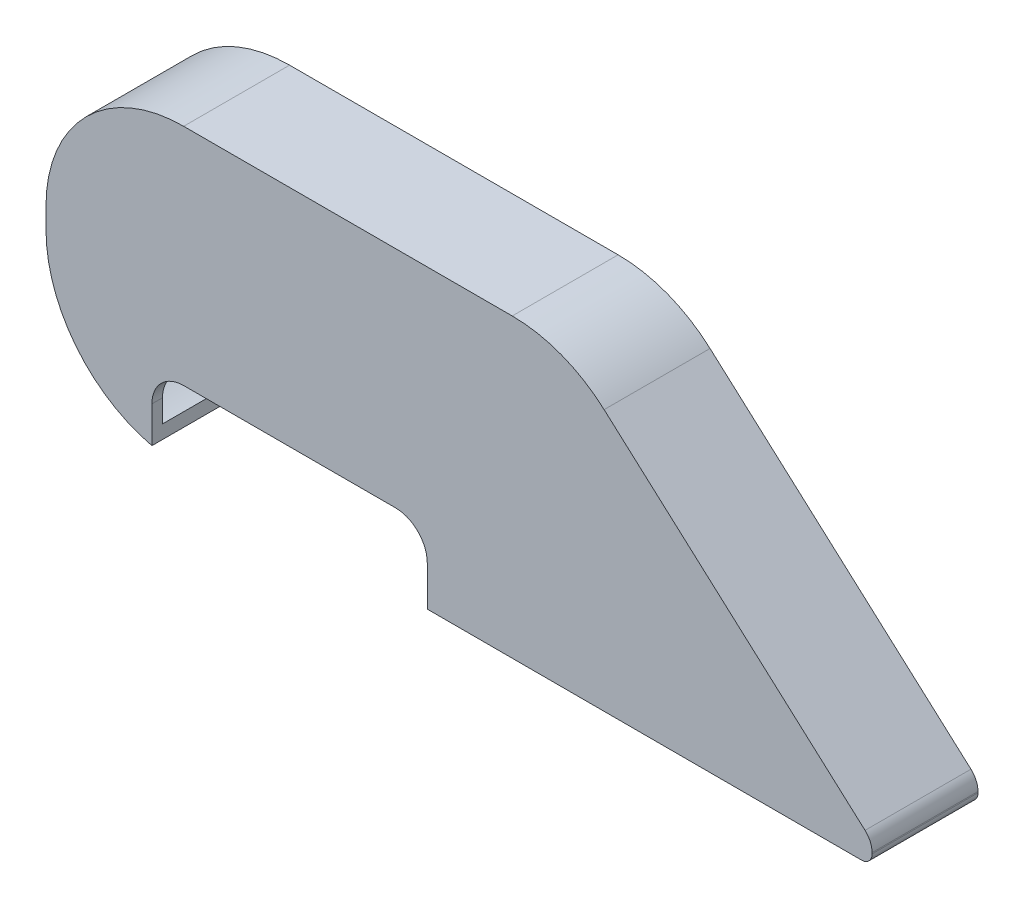
ISO-10303-21;
HEADER;
FILE_DESCRIPTION(('STEP AP214'),'2;1');
FILE_NAME('part.step','',(''),(''),'','','');
FILE_SCHEMA(('AUTOMOTIVE_DESIGN { 1 0 10303 214 1 1 1 1 }'));
ENDSEC;
DATA;
#1=APPLICATION_CONTEXT('core data for automotive mechanical design processes');
#2=APPLICATION_PROTOCOL_DEFINITION('international standard','automotive_design',2000,#1);
#3=PRODUCT_CONTEXT('',#1,'mechanical');
#4=PRODUCT('Part','Part','',(#3));
#5=PRODUCT_RELATED_PRODUCT_CATEGORY('part','',(#4));
#6=PRODUCT_DEFINITION_FORMATION('','',#4);
#7=PRODUCT_DEFINITION_CONTEXT('part definition',#1,'design');
#8=PRODUCT_DEFINITION('design','',#6,#7);
#9=PRODUCT_DEFINITION_SHAPE('','',#8);
#10=(LENGTH_UNIT() NAMED_UNIT(*) SI_UNIT(.MILLI.,.METRE.));
#11=(NAMED_UNIT(*) PLANE_ANGLE_UNIT() SI_UNIT($,.RADIAN.));
#12=(NAMED_UNIT(*) SI_UNIT($,.STERADIAN.) SOLID_ANGLE_UNIT());
#13=UNCERTAINTY_MEASURE_WITH_UNIT(LENGTH_MEASURE(1.E-05),#10,'distance_accuracy_value','');
#14=(GEOMETRIC_REPRESENTATION_CONTEXT(3) GLOBAL_UNCERTAINTY_ASSIGNED_CONTEXT((#13)) GLOBAL_UNIT_ASSIGNED_CONTEXT((#10,
#11,#12)) REPRESENTATION_CONTEXT('',''));
#15=CARTESIAN_POINT('',(0.,0.,0.));
#16=DIRECTION('',(0.,0.,1.));
#17=DIRECTION('',(1.,0.,0.));
#18=AXIS2_PLACEMENT_3D('',#15,#16,#17);
#19=CARTESIAN_POINT('',(0.,0.,0.));
#20=DIRECTION('',(0.,0.,-1.));
#21=DIRECTION('',(-1.,0.,0.));
#22=AXIS2_PLACEMENT_3D('',#19,#20,#21);
#23=PLANE('',#22);
#24=DIRECTION('',(0.,1.,0.));
#25=VECTOR('',#24,1.);
#26=CARTESIAN_POINT('',(11.0043937433295,0.,0.));
#27=LINE('',#26,#25);
#28=CARTESIAN_POINT('',(11.0043937433295,1.38069056825095,0.));
#29=VERTEX_POINT('',#28);
#30=CARTESIAN_POINT('',(11.0043937433295,2.66062873601207,0.));
#31=VERTEX_POINT('',#30);
#32=EDGE_CURVE('E353',#29,#31,#27,.T.);
#33=ORIENTED_EDGE('',*,*,#32,.F.);
#34=CARTESIAN_POINT('',(14.0043937433295,14.0298012089245,0.));
#35=DIRECTION('',(0.,0.,-1.));
#36=DIRECTION('',(-1.,0.,0.));
#37=AXIS2_PLACEMENT_3D('',#34,#35,#36);
#38=CIRCLE('',#37,13.);
#39=CARTESIAN_POINT('',(1.0043937433295,14.0298012089245,0.));
#40=VERTEX_POINT('',#39);
#41=EDGE_CURVE('E275',#29,#40,#38,.T.);
#42=ORIENTED_EDGE('',*,*,#41,.T.);
#43=DIRECTION('',(0.,-1.,0.));
#44=VECTOR('',#43,1.);
#45=CARTESIAN_POINT('',(1.0043937433295,28.998403262257,0.));
#46=LINE('',#45,#44);
#47=CARTESIAN_POINT('',(1.0043937433295,15.9991614446246,0.));
#48=VERTEX_POINT('',#47);
#49=EDGE_CURVE('E233',#48,#40,#46,.T.);
#50=ORIENTED_EDGE('',*,*,#49,.F.);
#51=CARTESIAN_POINT('',(14.0043937433295,15.9991614446246,0.));
#52=DIRECTION('',(0.,0.,-1.));
#53=DIRECTION('',(-1.,0.,0.));
#54=AXIS2_PLACEMENT_3D('',#51,#52,#53);
#55=CIRCLE('',#54,13.);
#56=CARTESIAN_POINT('',(14.0036355388527,28.999161422514,0.));
#57=VERTEX_POINT('',#56);
#58=EDGE_CURVE('E267',#48,#57,#55,.T.);
#59=ORIENTED_EDGE('',*,*,#58,.T.);
#60=DIRECTION('',(-0.999999998299189,-5.83234212952014E-05,0.));
#61=VECTOR('',#60,1.);
#62=CARTESIAN_POINT('',(50.,29.0012608536472,0.));
#63=LINE('',#62,#61);
#64=CARTESIAN_POINT('',(45.0257927198774,29.0009707408599,0.));
#65=VERTEX_POINT('',#64);
#66=EDGE_CURVE('E238',#65,#57,#63,.T.);
#67=ORIENTED_EDGE('',*,*,#66,.F.);
#68=CARTESIAN_POINT('',(45.0265509243543,16.0009707629704,0.));
#69=DIRECTION('',(0.,0.,-1.));
#70=DIRECTION('',(-1.,0.,0.));
#71=AXIS2_PLACEMENT_3D('',#68,#69,#70);
#72=CIRCLE('',#71,13.);
#73=CARTESIAN_POINT('',(53.7038964611965,25.6810365909616,0.));
#74=VERTEX_POINT('',#73);
#75=EDGE_CURVE('E284',#65,#74,#72,.T.);
#76=ORIENTED_EDGE('',*,*,#75,.T.);
#77=DIRECTION('',(-0.744620448307016,0.667488118218638,0.));
#78=VECTOR('',#77,1.);
#79=CARTESIAN_POINT('',(79.0058654003616,3.,0.));
#80=LINE('',#79,#78);
#81=CARTESIAN_POINT('',(78.3408416367989,3.59613654381962,0.));
#82=VERTEX_POINT('',#81);
#83=EDGE_CURVE('E393',#82,#74,#80,.T.);
#84=ORIENTED_EDGE('',*,*,#83,.F.);
#85=CARTESIAN_POINT('',(77.0058654003616,2.10689564720559,0.));
#86=DIRECTION('',(0.,0.,-1.));
#87=DIRECTION('',(-1.,0.,0.));
#88=AXIS2_PLACEMENT_3D('',#85,#86,#87);
#89=CIRCLE('',#88,2.);
#90=CARTESIAN_POINT('',(79.0058654003616,2.10689564720559,0.));
#91=VERTEX_POINT('',#90);
#92=EDGE_CURVE('E294',#82,#91,#89,.T.);
#93=ORIENTED_EDGE('',*,*,#92,.T.);
#94=DIRECTION('',(0.,1.,0.));
#95=VECTOR('',#94,1.);
#96=CARTESIAN_POINT('',(79.0058654003616,0.99365877458979,0.));
#97=LINE('',#96,#95);
#98=CARTESIAN_POINT('',(79.0058654003616,1.9942149231046,0.));
#99=VERTEX_POINT('',#98);
#100=EDGE_CURVE('E391',#99,#91,#97,.T.);
#101=ORIENTED_EDGE('',*,*,#100,.F.);
#102=CARTESIAN_POINT('',(78.0058654003616,1.9942149231046,0.));
#103=DIRECTION('',(0.,0.,-1.));
#104=DIRECTION('',(-1.,0.,0.));
#105=AXIS2_PLACEMENT_3D('',#102,#103,#104);
#106=CIRCLE('',#105,1.);
#107=CARTESIAN_POINT('',(78.0053094064973,0.994215077669201,0.));
#108=VERTEX_POINT('',#107);
#109=EDGE_CURVE('E302',#99,#108,#106,.T.);
#110=ORIENTED_EDGE('',*,*,#109,.T.);
#111=DIRECTION('',(0.999999845435399,-0.000555993864250044,0.));
#112=VECTOR('',#111,1.);
#113=CARTESIAN_POINT('',(1.0043937433295,1.03702712093678,0.));
#114=LINE('',#113,#112);
#115=CARTESIAN_POINT('',(37.0043937433295,1.01701133873005,0.));
#116=VERTEX_POINT('',#115);
#117=EDGE_CURVE('E389',#116,#108,#114,.T.);
#118=ORIENTED_EDGE('',*,*,#117,.F.);
#119=DIRECTION('',(0.,-1.,0.));
#120=VECTOR('',#119,1.);
#121=CARTESIAN_POINT('',(37.0043937433295,0.,0.));
#122=LINE('',#121,#120);
#123=CARTESIAN_POINT('',(37.0043937433295,2.01538120667124,0.));
#124=VERTEX_POINT('',#123);
#125=EDGE_CURVE('E203',#124,#116,#122,.T.);
#126=ORIENTED_EDGE('',*,*,#125,.F.);
#127=DIRECTION('',(-0.999999835320256,0.000573898475952586,0.));
#128=VECTOR('',#127,1.);
#129=CARTESIAN_POINT('',(2.00811371005572,2.03546552175382,0.));
#130=LINE('',#129,#128);
#131=CARTESIAN_POINT('',(77.5024113049082,1.9921394522861,0.));
#132=VERTEX_POINT('',#131);
#133=EDGE_CURVE('E382',#132,#124,#130,.T.);
#134=ORIENTED_EDGE('',*,*,#133,.F.);
#135=CARTESIAN_POINT('',(77.5026982541462,2.49213936994623,0.));
#136=DIRECTION('',(0.,0.,-1.));
#137=DIRECTION('',(-1.,0.,0.));
#138=AXIS2_PLACEMENT_3D('',#135,#136,#137);
#139=CIRCLE('',#138,0.5);
#140=CARTESIAN_POINT('',(78.0026982541462,2.49213936994623,0.));
#141=VERTEX_POINT('',#140);
#142=EDGE_CURVE('E313',#132,#141,#139,.F.);
#143=ORIENTED_EDGE('',*,*,#142,.T.);
#144=DIRECTION('',(0.,-1.,0.));
#145=VECTOR('',#144,1.);
#146=CARTESIAN_POINT('',(78.0026982541462,1.99185233832111,0.));
#147=LINE('',#146,#145);
#148=CARTESIAN_POINT('',(78.0026982541462,2.5522717028357,0.));
#149=VERTEX_POINT('',#148);
#150=EDGE_CURVE('E380',#149,#141,#147,.T.);
#151=ORIENTED_EDGE('',*,*,#150,.F.);
#152=CARTESIAN_POINT('',(77.0026982541462,2.5522717028357,0.));
#153=DIRECTION('',(0.,0.,-1.));
#154=DIRECTION('',(-1.,0.,0.));
#155=AXIS2_PLACEMENT_3D('',#152,#153,#154);
#156=CIRCLE('',#155,1.);
#157=CARTESIAN_POINT('',(77.6687254050708,3.29819920214866,0.));
#158=VERTEX_POINT('',#157);
#159=EDGE_CURVE('E323',#149,#158,#156,.F.);
#160=ORIENTED_EDGE('',*,*,#159,.T.);
#161=DIRECTION('',(0.74592749931296,-0.666027150924581,0.));
#162=VECTOR('',#161,1.);
#163=CARTESIAN_POINT('',(78.0026982541462,3.,0.));
#164=LINE('',#163,#162);
#165=CARTESIAN_POINT('',(53.6991819967723,24.7002345472675,0.));
#166=VERTEX_POINT('',#165);
#167=EDGE_CURVE('E207',#166,#158,#164,.T.);
#168=ORIENTED_EDGE('',*,*,#167,.F.);
#169=CARTESIAN_POINT('',(45.0408290347528,15.003177056199,0.));
#170=DIRECTION('',(0.,0.,-1.));
#171=DIRECTION('',(-1.,0.,0.));
#172=AXIS2_PLACEMENT_3D('',#169,#170,#171);
#173=CIRCLE('',#172,13.);
#174=CARTESIAN_POINT('',(45.0408290347528,28.003177056199,0.));
#175=VERTEX_POINT('',#174);
#176=EDGE_CURVE('E258',#166,#175,#173,.F.);
#177=ORIENTED_EDGE('',*,*,#176,.T.);
#178=DIRECTION('',(1.,0.,0.));
#179=VECTOR('',#178,1.);
#180=CARTESIAN_POINT('',(50.,28.003177056199,0.));
#181=LINE('',#180,#179);
#182=CARTESIAN_POINT('',(15.01040702453,28.003177056199,0.));
#183=VERTEX_POINT('',#182);
#184=EDGE_CURVE('E371',#183,#175,#181,.T.);
#185=ORIENTED_EDGE('',*,*,#184,.F.);
#186=CARTESIAN_POINT('',(15.01040702453,15.003177056199,0.));
#187=DIRECTION('',(0.,0.,-1.));
#188=DIRECTION('',(-1.,0.,0.));
#189=AXIS2_PLACEMENT_3D('',#186,#187,#188);
#190=CIRCLE('',#189,13.);
#191=CARTESIAN_POINT('',(2.01040722778299,15.0054758770304,0.));
#192=VERTEX_POINT('',#191);
#193=EDGE_CURVE('E243',#183,#192,#190,.F.);
#194=ORIENTED_EDGE('',*,*,#193,.T.);
#195=CARTESIAN_POINT('',(15.010387705005,15.0280056761324,0.));
#196=DIRECTION('',(0.,0.,-1.));
#197=DIRECTION('',(-1.,0.,0.));
#198=AXIS2_PLACEMENT_3D('',#195,#196,#197);
#199=CIRCLE('',#198,13.);
#200=EDGE_CURVE('E248',#192,#31,#199,.F.);
#201=ORIENTED_EDGE('',*,*,#200,.T.);
#202=EDGE_LOOP('',(#33,#42,#50,#59,#67,#76,#84,#93,#101,#110,#118,#126,#134,#143,#151,#160,#168,
#177,#185,#194,#201));
#203=FACE_BOUND('',#202,.T.);
#204=ADVANCED_FACE('F35',(#203),#23,.T.);
#205=CARTESIAN_POINT('',(1.0043937433295,28.998403262257,0.));
#206=DIRECTION('',(-1.,0.,0.));
#207=DIRECTION('',(0.,0.,1.));
#208=AXIS2_PLACEMENT_3D('',#205,#206,#207);
#209=PLANE('',#208);
#210=ORIENTED_EDGE('',*,*,#49,.T.);
#211=DIRECTION('',(0.,0.,1.));
#212=VECTOR('',#211,1.);
#213=CARTESIAN_POINT('',(1.0043937433295,14.0298012089245,0.));
#214=LINE('',#213,#212);
#215=CARTESIAN_POINT('',(1.0043937433295,14.0298012089245,10.));
#216=VERTEX_POINT('',#215);
#217=EDGE_CURVE('E270',#40,#216,#214,.T.);
#218=ORIENTED_EDGE('',*,*,#217,.T.);
#219=DIRECTION('',(0.,-1.,0.));
#220=VECTOR('',#219,1.);
#221=CARTESIAN_POINT('',(1.0043937433295,28.998403262257,10.));
#222=LINE('',#221,#220);
#223=CARTESIAN_POINT('',(1.0043937433295,15.9991614446246,10.));
#224=VERTEX_POINT('',#223);
#225=EDGE_CURVE('E221',#224,#216,#222,.T.);
#226=ORIENTED_EDGE('',*,*,#225,.F.);
#227=DIRECTION('',(0.,0.,1.));
#228=VECTOR('',#227,1.);
#229=CARTESIAN_POINT('',(1.0043937433295,15.9991614446246,0.));
#230=LINE('',#229,#228);
#231=EDGE_CURVE('E265',#224,#48,#230,.F.);
#232=ORIENTED_EDGE('',*,*,#231,.T.);
#233=EDGE_LOOP('',(#210,#218,#226,#232));
#234=FACE_BOUND('',#233,.T.);
#235=ADVANCED_FACE('F411',(#234),#209,.T.);
#236=CARTESIAN_POINT('',(50.,29.0012608536472,0.));
#237=DIRECTION('',(-5.83234212952014E-05,0.999999998299189,0.));
#238=DIRECTION('',(-0.999999998299189,-5.83234212952014E-05,0.));
#239=AXIS2_PLACEMENT_3D('',#236,#237,#238);
#240=PLANE('',#239);
#241=DIRECTION('',(-0.999999998299189,-5.83234212952014E-05,0.));
#242=VECTOR('',#241,1.);
#243=CARTESIAN_POINT('',(50.,29.0012608536472,10.));
#244=LINE('',#243,#242);
#245=CARTESIAN_POINT('',(45.0257927198774,29.0009707408599,10.));
#246=VERTEX_POINT('',#245);
#247=CARTESIAN_POINT('',(14.0036355388527,28.999161422514,10.));
#248=VERTEX_POINT('',#247);
#249=EDGE_CURVE('E231',#246,#248,#244,.T.);
#250=ORIENTED_EDGE('',*,*,#249,.F.);
#251=DIRECTION('',(0.,0.,1.));
#252=VECTOR('',#251,1.);
#253=CARTESIAN_POINT('',(45.0257927198774,29.0009707408599,0.));
#254=LINE('',#253,#252);
#255=EDGE_CURVE('E282',#246,#65,#254,.F.);
#256=ORIENTED_EDGE('',*,*,#255,.T.);
#257=ORIENTED_EDGE('',*,*,#66,.T.);
#258=DIRECTION('',(0.,0.,1.));
#259=VECTOR('',#258,1.);
#260=CARTESIAN_POINT('',(14.0036355388527,28.999161422514,0.));
#261=LINE('',#260,#259);
#262=EDGE_CURVE('E260',#57,#248,#261,.T.);
#263=ORIENTED_EDGE('',*,*,#262,.T.);
#264=EDGE_LOOP('',(#250,#256,#257,#263));
#265=FACE_BOUND('',#264,.T.);
#266=ADVANCED_FACE('F397',(#265),#240,.T.);
#267=CARTESIAN_POINT('',(79.0058654003616,3.,0.));
#268=DIRECTION('',(0.667488118218638,0.744620448307016,0.));
#269=DIRECTION('',(-0.744620448307016,0.667488118218638,0.));
#270=AXIS2_PLACEMENT_3D('',#267,#268,#269);
#271=PLANE('',#270);
#272=DIRECTION('',(-0.744620448307016,0.667488118218638,0.));
#273=VECTOR('',#272,1.);
#274=CARTESIAN_POINT('',(79.0058654003616,3.,10.));
#275=LINE('',#274,#273);
#276=CARTESIAN_POINT('',(78.3408416367989,3.59613654381962,10.));
#277=VERTEX_POINT('',#276);
#278=CARTESIAN_POINT('',(53.7038964611965,25.6810365909616,10.));
#279=VERTEX_POINT('',#278);
#280=EDGE_CURVE('E223',#277,#279,#275,.T.);
#281=ORIENTED_EDGE('',*,*,#280,.F.);
#282=DIRECTION('',(0.,0.,1.));
#283=VECTOR('',#282,1.);
#284=CARTESIAN_POINT('',(78.3408416367989,3.59613654381962,0.));
#285=LINE('',#284,#283);
#286=EDGE_CURVE('E292',#277,#82,#285,.F.);
#287=ORIENTED_EDGE('',*,*,#286,.T.);
#288=ORIENTED_EDGE('',*,*,#83,.T.);
#289=DIRECTION('',(0.,0.,1.));
#290=VECTOR('',#289,1.);
#291=CARTESIAN_POINT('',(53.7038964611965,25.6810365909616,0.));
#292=LINE('',#291,#290);
#293=EDGE_CURVE('E277',#74,#279,#292,.T.);
#294=ORIENTED_EDGE('',*,*,#293,.T.);
#295=EDGE_LOOP('',(#281,#287,#288,#294));
#296=FACE_BOUND('',#295,.T.);
#297=ADVANCED_FACE('F506',(#296),#271,.T.);
#298=CARTESIAN_POINT('',(79.0058654003616,0.99365877458979,0.));
#299=DIRECTION('',(1.,0.,0.));
#300=DIRECTION('',(0.,0.,-1.));
#301=AXIS2_PLACEMENT_3D('',#298,#299,#300);
#302=PLANE('',#301);
#303=DIRECTION('',(0.,1.,0.));
#304=VECTOR('',#303,1.);
#305=CARTESIAN_POINT('',(79.0058654003616,0.99365877458979,10.));
#306=LINE('',#305,#304);
#307=CARTESIAN_POINT('',(79.0058654003616,1.9942149231046,10.));
#308=VERTEX_POINT('',#307);
#309=CARTESIAN_POINT('',(79.0058654003616,2.10689564720559,10.));
#310=VERTEX_POINT('',#309);
#311=EDGE_CURVE('E220',#308,#310,#306,.T.);
#312=ORIENTED_EDGE('',*,*,#311,.F.);
#313=DIRECTION('',(0.,0.,1.));
#314=VECTOR('',#313,1.);
#315=CARTESIAN_POINT('',(79.0058654003616,1.9942149231046,0.));
#316=LINE('',#315,#314);
#317=EDGE_CURVE('E300',#308,#99,#316,.F.);
#318=ORIENTED_EDGE('',*,*,#317,.T.);
#319=ORIENTED_EDGE('',*,*,#100,.T.);
#320=DIRECTION('',(0.,0.,1.));
#321=VECTOR('',#320,1.);
#322=CARTESIAN_POINT('',(79.0058654003616,2.10689564720559,0.));
#323=LINE('',#322,#321);
#324=EDGE_CURVE('E287',#91,#310,#323,.T.);
#325=ORIENTED_EDGE('',*,*,#324,.T.);
#326=EDGE_LOOP('',(#312,#318,#319,#325));
#327=FACE_BOUND('',#326,.T.);
#328=ADVANCED_FACE('F499',(#327),#302,.T.);
#329=CARTESIAN_POINT('',(1.0043937433295,1.03702712093678,0.));
#330=DIRECTION('',(-0.000555993864250044,-0.999999845435399,0.));
#331=DIRECTION('',(0.9999998454354,-0.000555993864250045,0.));
#332=AXIS2_PLACEMENT_3D('',#329,#330,#331);
#333=PLANE('',#332);
#334=DIRECTION('',(0.,0.,1.));
#335=VECTOR('',#334,1.);
#336=CARTESIAN_POINT('',(37.0043937433295,1.01701133873005,0.));
#337=LINE('',#336,#335);
#338=CARTESIAN_POINT('',(37.0043937433295,1.01701133873005,10.));
#339=VERTEX_POINT('',#338);
#340=EDGE_CURVE('E199',#116,#339,#337,.T.);
#341=ORIENTED_EDGE('',*,*,#340,.F.);
#342=ORIENTED_EDGE('',*,*,#117,.T.);
#343=DIRECTION('',(0.,0.,1.));
#344=VECTOR('',#343,1.);
#345=CARTESIAN_POINT('',(78.0053094064973,0.994215077669201,0.));
#346=LINE('',#345,#344);
#347=CARTESIAN_POINT('',(78.0053094064973,0.994215077669201,10.));
#348=VERTEX_POINT('',#347);
#349=EDGE_CURVE('E219',#108,#348,#346,.T.);
#350=ORIENTED_EDGE('',*,*,#349,.T.);
#351=DIRECTION('',(0.999999845435399,-0.000555993864250044,0.));
#352=VECTOR('',#351,1.);
#353=CARTESIAN_POINT('',(1.0043937433295,1.03702712093678,10.));
#354=LINE('',#353,#352);
#355=EDGE_CURVE('E211',#339,#348,#354,.T.);
#356=ORIENTED_EDGE('',*,*,#355,.F.);
#357=EDGE_LOOP('',(#341,#342,#350,#356));
#358=FACE_BOUND('',#357,.T.);
#359=ADVANCED_FACE('F217',(#358),#333,.T.);
#360=CARTESIAN_POINT('',(0.,0.,10.));
#361=DIRECTION('',(0.,0.,-1.));
#362=DIRECTION('',(-1.,0.,0.));
#363=AXIS2_PLACEMENT_3D('',#360,#361,#362);
#364=PLANE('',#363);
#365=CARTESIAN_POINT('',(14.0043937433295,14.0298012089245,10.));
#366=DIRECTION('',(0.,0.,-1.));
#367=DIRECTION('',(-1.,0.,0.));
#368=AXIS2_PLACEMENT_3D('',#365,#366,#367);
#369=CIRCLE('',#368,13.);
#370=CARTESIAN_POINT('',(11.0043937433295,1.38069056825095,10.));
#371=VERTEX_POINT('',#370);
#372=EDGE_CURVE('E273',#216,#371,#369,.F.);
#373=ORIENTED_EDGE('',*,*,#372,.T.);
#374=DIRECTION('',(0.,-1.,0.));
#375=VECTOR('',#374,1.);
#376=CARTESIAN_POINT('',(11.0043937433295,7.80035201388995,10.));
#377=LINE('',#376,#375);
#378=CARTESIAN_POINT('',(11.0043937433295,4.80035201388995,10.));
#379=VERTEX_POINT('',#378);
#380=EDGE_CURVE('E214',#379,#371,#377,.T.);
#381=ORIENTED_EDGE('',*,*,#380,.F.);
#382=CARTESIAN_POINT('',(14.0043937433295,4.80035201388995,10.));
#383=DIRECTION('',(0.,0.,-1.));
#384=DIRECTION('',(-1.,0.,0.));
#385=AXIS2_PLACEMENT_3D('',#382,#383,#384);
#386=CIRCLE('',#385,3.);
#387=CARTESIAN_POINT('',(14.0043937433295,7.80035201388995,10.));
#388=VERTEX_POINT('',#387);
#389=EDGE_CURVE('E337',#379,#388,#386,.T.);
#390=ORIENTED_EDGE('',*,*,#389,.T.);
#391=DIRECTION('',(-1.,0.,0.));
#392=VECTOR('',#391,1.);
#393=CARTESIAN_POINT('',(11.0043937433295,7.80035201388995,10.));
#394=LINE('',#393,#392);
#395=CARTESIAN_POINT('',(34.0043937433295,7.80035201388995,10.));
#396=VERTEX_POINT('',#395);
#397=EDGE_CURVE('E213',#396,#388,#394,.T.);
#398=ORIENTED_EDGE('',*,*,#397,.F.);
#399=CARTESIAN_POINT('',(34.0043937433295,4.80035201388995,10.));
#400=DIRECTION('',(0.,0.,-1.));
#401=DIRECTION('',(-1.,0.,0.));
#402=AXIS2_PLACEMENT_3D('',#399,#400,#401);
#403=CIRCLE('',#402,3.);
#404=CARTESIAN_POINT('',(37.0043937433295,4.80035201388995,10.));
#405=VERTEX_POINT('',#404);
#406=EDGE_CURVE('E43',#396,#405,#403,.T.);
#407=ORIENTED_EDGE('',*,*,#406,.T.);
#408=DIRECTION('',(0.,1.,0.));
#409=VECTOR('',#408,1.);
#410=CARTESIAN_POINT('',(37.0043937433295,7.80035201388995,10.));
#411=LINE('',#410,#409);
#412=EDGE_CURVE('E201',#339,#405,#411,.T.);
#413=ORIENTED_EDGE('',*,*,#412,.F.);
#414=ORIENTED_EDGE('',*,*,#355,.T.);
#415=CARTESIAN_POINT('',(78.0058654003616,1.9942149231046,10.));
#416=DIRECTION('',(0.,0.,-1.));
#417=DIRECTION('',(-1.,0.,0.));
#418=AXIS2_PLACEMENT_3D('',#415,#416,#417);
#419=CIRCLE('',#418,1.);
#420=EDGE_CURVE('E298',#348,#308,#419,.F.);
#421=ORIENTED_EDGE('',*,*,#420,.T.);
#422=ORIENTED_EDGE('',*,*,#311,.T.);
#423=CARTESIAN_POINT('',(77.0058654003616,2.10689564720559,10.));
#424=DIRECTION('',(0.,0.,-1.));
#425=DIRECTION('',(-1.,0.,0.));
#426=AXIS2_PLACEMENT_3D('',#423,#424,#425);
#427=CIRCLE('',#426,2.);
#428=EDGE_CURVE('E290',#310,#277,#427,.F.);
#429=ORIENTED_EDGE('',*,*,#428,.T.);
#430=ORIENTED_EDGE('',*,*,#280,.T.);
#431=CARTESIAN_POINT('',(45.0265509243543,16.0009707629704,10.));
#432=DIRECTION('',(0.,0.,-1.));
#433=DIRECTION('',(-1.,0.,0.));
#434=AXIS2_PLACEMENT_3D('',#431,#432,#433);
#435=CIRCLE('',#434,13.);
#436=EDGE_CURVE('E280',#279,#246,#435,.F.);
#437=ORIENTED_EDGE('',*,*,#436,.T.);
#438=ORIENTED_EDGE('',*,*,#249,.T.);
#439=CARTESIAN_POINT('',(14.0043937433295,15.9991614446246,10.));
#440=DIRECTION('',(0.,0.,-1.));
#441=DIRECTION('',(-1.,0.,0.));
#442=AXIS2_PLACEMENT_3D('',#439,#440,#441);
#443=CIRCLE('',#442,13.);
#444=EDGE_CURVE('E263',#248,#224,#443,.F.);
#445=ORIENTED_EDGE('',*,*,#444,.T.);
#446=ORIENTED_EDGE('',*,*,#225,.T.);
#447=EDGE_LOOP('',(#373,#381,#390,#398,#407,#413,#414,#421,#422,#429,#430,#437,#438,#445,#446));
#448=FACE_BOUND('',#447,.T.);
#449=ADVANCED_FACE('F210',(#448),#364,.F.);
#450=CARTESIAN_POINT('',(78.0026982541462,3.,8.99999999999999));
#451=DIRECTION('',(0.666027150924581,0.74592749931296,0.));
#452=DIRECTION('',(-0.74592749931296,0.666027150924581,0.));
#453=AXIS2_PLACEMENT_3D('',#450,#451,#452);
#454=PLANE('',#453);
#455=ORIENTED_EDGE('',*,*,#167,.T.);
#456=DIRECTION('',(0.,0.,-1.));
#457=VECTOR('',#456,1.);
#458=CARTESIAN_POINT('',(77.6687254050708,3.29819920214866,8.99999999999999));
#459=LINE('',#458,#457);
#460=CARTESIAN_POINT('',(77.6687254050708,3.29819920214866,8.99999999999999));
#461=VERTEX_POINT('',#460);
#462=EDGE_CURVE('E319',#158,#461,#459,.F.);
#463=ORIENTED_EDGE('',*,*,#462,.T.);
#464=DIRECTION('',(0.74592749931296,-0.666027150924581,0.));
#465=VECTOR('',#464,1.);
#466=CARTESIAN_POINT('',(78.0026982541462,3.,8.99999999999999));
#467=LINE('',#466,#465);
#468=CARTESIAN_POINT('',(53.6991819967723,24.7002345472675,8.99999999999999));
#469=VERTEX_POINT('',#468);
#470=EDGE_CURVE('E367',#469,#461,#467,.T.);
#471=ORIENTED_EDGE('',*,*,#470,.F.);
#472=DIRECTION('',(0.,0.,-1.));
#473=VECTOR('',#472,1.);
#474=CARTESIAN_POINT('',(53.6991819967723,24.7002345472675,0.));
#475=LINE('',#474,#473);
#476=EDGE_CURVE('E251',#469,#166,#475,.T.);
#477=ORIENTED_EDGE('',*,*,#476,.T.);
#478=EDGE_LOOP('',(#455,#463,#471,#477));
#479=FACE_BOUND('',#478,.T.);
#480=ADVANCED_FACE('F523',(#479),#454,.F.);
#481=CARTESIAN_POINT('',(50.,28.003177056199,8.99999999999999));
#482=DIRECTION('',(0.,1.,0.));
#483=DIRECTION('',(-1.,0.,0.));
#484=AXIS2_PLACEMENT_3D('',#481,#482,#483);
#485=PLANE('',#484);
#486=ORIENTED_EDGE('',*,*,#184,.T.);
#487=DIRECTION('',(0.,0.,-1.));
#488=VECTOR('',#487,1.);
#489=CARTESIAN_POINT('',(45.0408290347528,28.003177056199,8.99999999999999));
#490=LINE('',#489,#488);
#491=CARTESIAN_POINT('',(45.0408290347528,28.003177056199,8.99999999999999));
#492=VERTEX_POINT('',#491);
#493=EDGE_CURVE('E254',#175,#492,#490,.F.);
#494=ORIENTED_EDGE('',*,*,#493,.T.);
#495=DIRECTION('',(1.,0.,0.));
#496=VECTOR('',#495,1.);
#497=CARTESIAN_POINT('',(50.,28.003177056199,8.99999999999999));
#498=LINE('',#497,#496);
#499=CARTESIAN_POINT('',(15.01040702453,28.003177056199,8.99999999999999));
#500=VERTEX_POINT('',#499);
#501=EDGE_CURVE('E226',#500,#492,#498,.T.);
#502=ORIENTED_EDGE('',*,*,#501,.F.);
#503=DIRECTION('',(0.,0.,-1.));
#504=VECTOR('',#503,1.);
#505=CARTESIAN_POINT('',(15.01040702453,28.003177056199,0.));
#506=LINE('',#505,#504);
#507=EDGE_CURVE('E234',#500,#183,#506,.T.);
#508=ORIENTED_EDGE('',*,*,#507,.T.);
#509=EDGE_LOOP('',(#486,#494,#502,#508));
#510=FACE_BOUND('',#509,.T.);
#511=ADVANCED_FACE('F527',(#510),#485,.F.);
#512=CARTESIAN_POINT('',(2.00811371005572,2.03546552175382,8.99999999999999));
#513=DIRECTION('',(-0.000573898475952586,-0.999999835320256,0.));
#514=DIRECTION('',(0.999999835320256,-0.000573898475952586,0.));
#515=AXIS2_PLACEMENT_3D('',#512,#513,#514);
#516=PLANE('',#515);
#517=ORIENTED_EDGE('',*,*,#133,.T.);
#518=DIRECTION('',(0.,0.,1.));
#519=VECTOR('',#518,1.);
#520=CARTESIAN_POINT('',(37.0043937433295,2.01538120667124,8.99999999999999));
#521=LINE('',#520,#519);
#522=CARTESIAN_POINT('',(37.0043937433295,2.01538120667124,8.99999999999999));
#523=VERTEX_POINT('',#522);
#524=EDGE_CURVE('E363',#124,#523,#521,.T.);
#525=ORIENTED_EDGE('',*,*,#524,.T.);
#526=DIRECTION('',(-0.999999835320256,0.000573898475952586,0.));
#527=VECTOR('',#526,1.);
#528=CARTESIAN_POINT('',(2.00811371005572,2.03546552175382,8.99999999999999));
#529=LINE('',#528,#527);
#530=CARTESIAN_POINT('',(77.5024113049082,1.9921394522861,8.99999999999999));
#531=VERTEX_POINT('',#530);
#532=EDGE_CURVE('E373',#531,#523,#529,.T.);
#533=ORIENTED_EDGE('',*,*,#532,.F.);
#534=DIRECTION('',(0.,0.,-1.));
#535=VECTOR('',#534,1.);
#536=CARTESIAN_POINT('',(77.5024113049082,1.9921394522861,0.));
#537=LINE('',#536,#535);
#538=EDGE_CURVE('E305',#531,#132,#537,.T.);
#539=ORIENTED_EDGE('',*,*,#538,.T.);
#540=EDGE_LOOP('',(#517,#525,#533,#539));
#541=FACE_BOUND('',#540,.T.);
#542=ADVANCED_FACE('F491',(#541),#516,.F.);
#543=CARTESIAN_POINT('',(78.0026982541462,1.99185233832111,8.99999999999999));
#544=DIRECTION('',(1.,0.,0.));
#545=DIRECTION('',(0.,0.,-1.));
#546=AXIS2_PLACEMENT_3D('',#543,#544,#545);
#547=PLANE('',#546);
#548=DIRECTION('',(0.,-1.,0.));
#549=VECTOR('',#548,1.);
#550=CARTESIAN_POINT('',(78.0026982541462,1.99185233832111,8.99999999999999));
#551=LINE('',#550,#549);
#552=CARTESIAN_POINT('',(78.0026982541462,2.5522717028357,8.99999999999999));
#553=VERTEX_POINT('',#552);
#554=CARTESIAN_POINT('',(78.0026982541462,2.49213936994623,8.99999999999999));
#555=VERTEX_POINT('',#554);
#556=EDGE_CURVE('E370',#553,#555,#551,.T.);
#557=ORIENTED_EDGE('',*,*,#556,.F.);
#558=DIRECTION('',(0.,0.,-1.));
#559=VECTOR('',#558,1.);
#560=CARTESIAN_POINT('',(78.0026982541462,2.5522717028357,0.));
#561=LINE('',#560,#559);
#562=EDGE_CURVE('E316',#553,#149,#561,.T.);
#563=ORIENTED_EDGE('',*,*,#562,.T.);
#564=ORIENTED_EDGE('',*,*,#150,.T.);
#565=DIRECTION('',(0.,0.,-1.));
#566=VECTOR('',#565,1.);
#567=CARTESIAN_POINT('',(78.0026982541462,2.49213936994623,8.99999999999999));
#568=LINE('',#567,#566);
#569=EDGE_CURVE('E308',#141,#555,#568,.F.);
#570=ORIENTED_EDGE('',*,*,#569,.T.);
#571=EDGE_LOOP('',(#557,#563,#564,#570));
#572=FACE_BOUND('',#571,.T.);
#573=ADVANCED_FACE('F484',(#572),#547,.F.);
#574=CARTESIAN_POINT('',(0.,0.,8.99999999999999));
#575=DIRECTION('',(0.,0.,1.));
#576=DIRECTION('',(1.,0.,0.));
#577=AXIS2_PLACEMENT_3D('',#574,#575,#576);
#578=PLANE('',#577);
#579=DIRECTION('',(0.,1.,0.));
#580=VECTOR('',#579,1.);
#581=CARTESIAN_POINT('',(37.0043937433295,0.,8.99999999999999));
#582=LINE('',#581,#580);
#583=CARTESIAN_POINT('',(37.0043937433295,4.80035201388995,8.99999999999999));
#584=VERTEX_POINT('',#583);
#585=EDGE_CURVE('E327',#523,#584,#582,.T.);
#586=ORIENTED_EDGE('',*,*,#585,.T.);
#587=CARTESIAN_POINT('',(34.0043937433295,4.80035201388995,8.99999999999999));
#588=DIRECTION('',(0.,0.,1.));
#589=DIRECTION('',(1.,0.,0.));
#590=AXIS2_PLACEMENT_3D('',#587,#588,#589);
#591=CIRCLE('',#590,3.);
#592=CARTESIAN_POINT('',(34.0043937433295,7.80035201388995,8.99999999999999));
#593=VERTEX_POINT('',#592);
#594=EDGE_CURVE('E12',#584,#593,#591,.T.);
#595=ORIENTED_EDGE('',*,*,#594,.T.);
#596=DIRECTION('',(-1.,0.,0.));
#597=VECTOR('',#596,1.);
#598=CARTESIAN_POINT('',(0.,7.80035201388995,8.99999999999999));
#599=LINE('',#598,#597);
#600=CARTESIAN_POINT('',(14.0043937433295,7.80035201388995,8.99999999999999));
#601=VERTEX_POINT('',#600);
#602=EDGE_CURVE('E329',#593,#601,#599,.T.);
#603=ORIENTED_EDGE('',*,*,#602,.T.);
#604=CARTESIAN_POINT('',(14.0043937433295,4.80035201388995,8.99999999999999));
#605=DIRECTION('',(0.,0.,1.));
#606=DIRECTION('',(1.,0.,0.));
#607=AXIS2_PLACEMENT_3D('',#604,#605,#606);
#608=CIRCLE('',#607,3.);
#609=CARTESIAN_POINT('',(11.0043937433295,4.80035201388995,8.99999999999999));
#610=VERTEX_POINT('',#609);
#611=EDGE_CURVE('E340',#601,#610,#608,.T.);
#612=ORIENTED_EDGE('',*,*,#611,.T.);
#613=DIRECTION('',(0.,-1.,0.));
#614=VECTOR('',#613,1.);
#615=CARTESIAN_POINT('',(11.0043937433295,0.,8.99999999999999));
#616=LINE('',#615,#614);
#617=CARTESIAN_POINT('',(11.0043937433295,2.66062873601207,8.99999999999999));
#618=VERTEX_POINT('',#617);
#619=EDGE_CURVE('E361',#610,#618,#616,.T.);
#620=ORIENTED_EDGE('',*,*,#619,.T.);
#621=CARTESIAN_POINT('',(15.010387705005,15.0280056761324,8.99999999999999));
#622=DIRECTION('',(0.,0.,1.));
#623=DIRECTION('',(1.,0.,0.));
#624=AXIS2_PLACEMENT_3D('',#621,#622,#623);
#625=CIRCLE('',#624,13.);
#626=CARTESIAN_POINT('',(2.01040722778299,15.0054758770304,8.99999999999999));
#627=VERTEX_POINT('',#626);
#628=EDGE_CURVE('E246',#618,#627,#625,.F.);
#629=ORIENTED_EDGE('',*,*,#628,.T.);
#630=CARTESIAN_POINT('',(15.01040702453,15.003177056199,8.99999999999999));
#631=DIRECTION('',(0.,0.,1.));
#632=DIRECTION('',(1.,0.,0.));
#633=AXIS2_PLACEMENT_3D('',#630,#631,#632);
#634=CIRCLE('',#633,13.);
#635=EDGE_CURVE('E241',#627,#500,#634,.F.);
#636=ORIENTED_EDGE('',*,*,#635,.T.);
#637=ORIENTED_EDGE('',*,*,#501,.T.);
#638=CARTESIAN_POINT('',(45.0408290347528,15.003177056199,8.99999999999999));
#639=DIRECTION('',(0.,0.,1.));
#640=DIRECTION('',(1.,0.,0.));
#641=AXIS2_PLACEMENT_3D('',#638,#639,#640);
#642=CIRCLE('',#641,13.);
#643=EDGE_CURVE('E256',#492,#469,#642,.F.);
#644=ORIENTED_EDGE('',*,*,#643,.T.);
#645=ORIENTED_EDGE('',*,*,#470,.T.);
#646=CARTESIAN_POINT('',(77.0026982541462,2.5522717028357,8.99999999999999));
#647=DIRECTION('',(0.,0.,1.));
#648=DIRECTION('',(1.,0.,0.));
#649=AXIS2_PLACEMENT_3D('',#646,#647,#648);
#650=CIRCLE('',#649,1.);
#651=EDGE_CURVE('E321',#461,#553,#650,.F.);
#652=ORIENTED_EDGE('',*,*,#651,.T.);
#653=ORIENTED_EDGE('',*,*,#556,.T.);
#654=CARTESIAN_POINT('',(77.5026982541462,2.49213936994623,8.99999999999999));
#655=DIRECTION('',(0.,0.,1.));
#656=DIRECTION('',(1.,0.,0.));
#657=AXIS2_PLACEMENT_3D('',#654,#655,#656);
#658=CIRCLE('',#657,0.5);
#659=EDGE_CURVE('E311',#555,#531,#658,.F.);
#660=ORIENTED_EDGE('',*,*,#659,.T.);
#661=ORIENTED_EDGE('',*,*,#532,.T.);
#662=EDGE_LOOP('',(#586,#595,#603,#612,#620,#629,#636,#637,#644,#645,#652,#653,#660,#661));
#663=FACE_BOUND('',#662,.T.);
#664=ADVANCED_FACE('F426',(#663),#578,.F.);
#665=CARTESIAN_POINT('',(15.01040702453,15.003177056199,8.99999999999999));
#666=DIRECTION('',(0.,0.,1.));
#667=DIRECTION('',(1.,0.,0.));
#668=AXIS2_PLACEMENT_3D('',#665,#666,#667);
#669=CYLINDRICAL_SURFACE('',#668,13.);
#670=ORIENTED_EDGE('',*,*,#635,.F.);
#671=DIRECTION('',(0.,0.,-1.));
#672=VECTOR('',#671,1.);
#673=CARTESIAN_POINT('',(2.01040722778299,15.0054758770304,8.99999999999999));
#674=LINE('',#673,#672);
#675=EDGE_CURVE('E237',#192,#627,#674,.F.);
#676=ORIENTED_EDGE('',*,*,#675,.F.);
#677=ORIENTED_EDGE('',*,*,#193,.F.);
#678=ORIENTED_EDGE('',*,*,#507,.F.);
#679=EDGE_LOOP('',(#670,#676,#677,#678));
#680=FACE_BOUND('',#679,.T.);
#681=ADVANCED_FACE('F439',(#680),#669,.F.);
#682=CARTESIAN_POINT('',(15.010387705005,15.0280056761324,8.99999999999999));
#683=DIRECTION('',(0.,0.,-1.));
#684=DIRECTION('',(-1.,0.,0.));
#685=AXIS2_PLACEMENT_3D('',#682,#683,#684);
#686=CYLINDRICAL_SURFACE('',#685,13.);
#687=ORIENTED_EDGE('',*,*,#628,.F.);
#688=DIRECTION('',(0.,0.,-1.));
#689=VECTOR('',#688,1.);
#690=CARTESIAN_POINT('',(11.0043937433295,2.66062873601207,8.99999999999999));
#691=LINE('',#690,#689);
#692=EDGE_CURVE('E355',#618,#31,#691,.T.);
#693=ORIENTED_EDGE('',*,*,#692,.T.);
#694=ORIENTED_EDGE('',*,*,#200,.F.);
#695=ORIENTED_EDGE('',*,*,#675,.T.);
#696=EDGE_LOOP('',(#687,#693,#694,#695));
#697=FACE_BOUND('',#696,.T.);
#698=ADVANCED_FACE('F442',(#697),#686,.F.);
#699=CARTESIAN_POINT('',(45.0408290347528,15.003177056199,8.99999999999999));
#700=DIRECTION('',(0.,0.,1.));
#701=DIRECTION('',(1.,0.,0.));
#702=AXIS2_PLACEMENT_3D('',#699,#700,#701);
#703=CYLINDRICAL_SURFACE('',#702,13.);
#704=ORIENTED_EDGE('',*,*,#643,.F.);
#705=ORIENTED_EDGE('',*,*,#493,.F.);
#706=ORIENTED_EDGE('',*,*,#176,.F.);
#707=ORIENTED_EDGE('',*,*,#476,.F.);
#708=EDGE_LOOP('',(#704,#705,#706,#707));
#709=FACE_BOUND('',#708,.T.);
#710=ADVANCED_FACE('F446',(#709),#703,.F.);
#711=CARTESIAN_POINT('',(14.0043937433295,15.9991614446246,0.));
#712=DIRECTION('',(0.,0.,1.));
#713=DIRECTION('',(1.,0.,0.));
#714=AXIS2_PLACEMENT_3D('',#711,#712,#713);
#715=CYLINDRICAL_SURFACE('',#714,13.);
#716=ORIENTED_EDGE('',*,*,#58,.F.);
#717=ORIENTED_EDGE('',*,*,#231,.F.);
#718=ORIENTED_EDGE('',*,*,#444,.F.);
#719=ORIENTED_EDGE('',*,*,#262,.F.);
#720=EDGE_LOOP('',(#716,#717,#718,#719));
#721=FACE_BOUND('',#720,.T.);
#722=ADVANCED_FACE('F408',(#721),#715,.T.);
#723=CARTESIAN_POINT('',(14.0043937433295,14.0298012089245,0.));
#724=DIRECTION('',(0.,0.,1.));
#725=DIRECTION('',(1.,0.,0.));
#726=AXIS2_PLACEMENT_3D('',#723,#724,#725);
#727=CYLINDRICAL_SURFACE('',#726,13.);
#728=DIRECTION('',(0.,0.,1.));
#729=VECTOR('',#728,1.);
#730=CARTESIAN_POINT('',(11.0043937433295,1.38069056825095,0.));
#731=LINE('',#730,#729);
#732=EDGE_CURVE('E325',#371,#29,#731,.F.);
#733=ORIENTED_EDGE('',*,*,#732,.F.);
#734=ORIENTED_EDGE('',*,*,#372,.F.);
#735=ORIENTED_EDGE('',*,*,#217,.F.);
#736=ORIENTED_EDGE('',*,*,#41,.F.);
#737=EDGE_LOOP('',(#733,#734,#735,#736));
#738=FACE_BOUND('',#737,.T.);
#739=ADVANCED_FACE('F416',(#738),#727,.T.);
#740=CARTESIAN_POINT('',(45.0265509243543,16.0009707629704,0.));
#741=DIRECTION('',(0.,0.,1.));
#742=DIRECTION('',(1.,0.,0.));
#743=AXIS2_PLACEMENT_3D('',#740,#741,#742);
#744=CYLINDRICAL_SURFACE('',#743,13.);
#745=ORIENTED_EDGE('',*,*,#75,.F.);
#746=ORIENTED_EDGE('',*,*,#255,.F.);
#747=ORIENTED_EDGE('',*,*,#436,.F.);
#748=ORIENTED_EDGE('',*,*,#293,.F.);
#749=EDGE_LOOP('',(#745,#746,#747,#748));
#750=FACE_BOUND('',#749,.T.);
#751=ADVANCED_FACE('F455',(#750),#744,.T.);
#752=CARTESIAN_POINT('',(77.0058654003616,2.10689564720559,0.));
#753=DIRECTION('',(0.,0.,1.));
#754=DIRECTION('',(1.,0.,0.));
#755=AXIS2_PLACEMENT_3D('',#752,#753,#754);
#756=CYLINDRICAL_SURFACE('',#755,2.);
#757=ORIENTED_EDGE('',*,*,#92,.F.);
#758=ORIENTED_EDGE('',*,*,#286,.F.);
#759=ORIENTED_EDGE('',*,*,#428,.F.);
#760=ORIENTED_EDGE('',*,*,#324,.F.);
#761=EDGE_LOOP('',(#757,#758,#759,#760));
#762=FACE_BOUND('',#761,.T.);
#763=ADVANCED_FACE('F458',(#762),#756,.T.);
#764=CARTESIAN_POINT('',(78.0058654003616,1.9942149231046,0.));
#765=DIRECTION('',(0.,0.,1.));
#766=DIRECTION('',(1.,0.,0.));
#767=AXIS2_PLACEMENT_3D('',#764,#765,#766);
#768=CYLINDRICAL_SURFACE('',#767,1.);
#769=ORIENTED_EDGE('',*,*,#109,.F.);
#770=ORIENTED_EDGE('',*,*,#317,.F.);
#771=ORIENTED_EDGE('',*,*,#420,.F.);
#772=ORIENTED_EDGE('',*,*,#349,.F.);
#773=EDGE_LOOP('',(#769,#770,#771,#772));
#774=FACE_BOUND('',#773,.T.);
#775=ADVANCED_FACE('F462',(#774),#768,.T.);
#776=CARTESIAN_POINT('',(77.5026982541462,2.49213936994623,8.99999999999999));
#777=DIRECTION('',(0.,0.,1.));
#778=DIRECTION('',(1.,0.,0.));
#779=AXIS2_PLACEMENT_3D('',#776,#777,#778);
#780=CYLINDRICAL_SURFACE('',#779,0.5);
#781=ORIENTED_EDGE('',*,*,#659,.F.);
#782=ORIENTED_EDGE('',*,*,#569,.F.);
#783=ORIENTED_EDGE('',*,*,#142,.F.);
#784=ORIENTED_EDGE('',*,*,#538,.F.);
#785=EDGE_LOOP('',(#781,#782,#783,#784));
#786=FACE_BOUND('',#785,.T.);
#787=ADVANCED_FACE('F466',(#786),#780,.F.);
#788=CARTESIAN_POINT('',(77.0026982541462,2.5522717028357,8.99999999999999));
#789=DIRECTION('',(0.,0.,1.));
#790=DIRECTION('',(1.,0.,0.));
#791=AXIS2_PLACEMENT_3D('',#788,#789,#790);
#792=CYLINDRICAL_SURFACE('',#791,1.);
#793=ORIENTED_EDGE('',*,*,#651,.F.);
#794=ORIENTED_EDGE('',*,*,#462,.F.);
#795=ORIENTED_EDGE('',*,*,#159,.F.);
#796=ORIENTED_EDGE('',*,*,#562,.F.);
#797=EDGE_LOOP('',(#793,#794,#795,#796));
#798=FACE_BOUND('',#797,.T.);
#799=ADVANCED_FACE('F470',(#798),#792,.F.);
#800=CARTESIAN_POINT('',(11.0043937433295,7.80035201388995,-4.99999999999999));
#801=DIRECTION('',(0.,1.,0.));
#802=DIRECTION('',(0.,0.,1.));
#803=AXIS2_PLACEMENT_3D('',#800,#801,#802);
#804=PLANE('',#803);
#805=ORIENTED_EDGE('',*,*,#602,.F.);
#806=DIRECTION('',(0.,0.,1.));
#807=VECTOR('',#806,1.);
#808=CARTESIAN_POINT('',(34.0043937433295,7.80035201388995,10.));
#809=LINE('',#808,#807);
#810=EDGE_CURVE('E342',#593,#396,#809,.T.);
#811=ORIENTED_EDGE('',*,*,#810,.T.);
#812=ORIENTED_EDGE('',*,*,#397,.T.);
#813=DIRECTION('',(0.,0.,1.));
#814=VECTOR('',#813,1.);
#815=CARTESIAN_POINT('',(14.0043937433295,7.80035201388995,8.99999999999999));
#816=LINE('',#815,#814);
#817=EDGE_CURVE('E334',#388,#601,#816,.F.);
#818=ORIENTED_EDGE('',*,*,#817,.T.);
#819=EDGE_LOOP('',(#805,#811,#812,#818));
#820=FACE_BOUND('',#819,.T.);
#821=ADVANCED_FACE('F348',(#820),#804,.F.);
#822=CARTESIAN_POINT('',(11.0043937433295,7.80035201388995,-4.99999999999999));
#823=DIRECTION('',(-1.,0.,0.));
#824=DIRECTION('',(0.,-1.,0.));
#825=AXIS2_PLACEMENT_3D('',#822,#823,#824);
#826=PLANE('',#825);
#827=ORIENTED_EDGE('',*,*,#619,.F.);
#828=DIRECTION('',(0.,0.,1.));
#829=VECTOR('',#828,1.);
#830=CARTESIAN_POINT('',(11.0043937433295,4.80035201388995,10.));
#831=LINE('',#830,#829);
#832=EDGE_CURVE('E331',#610,#379,#831,.T.);
#833=ORIENTED_EDGE('',*,*,#832,.T.);
#834=ORIENTED_EDGE('',*,*,#380,.T.);
#835=ORIENTED_EDGE('',*,*,#732,.T.);
#836=ORIENTED_EDGE('',*,*,#32,.T.);
#837=ORIENTED_EDGE('',*,*,#692,.F.);
#838=EDGE_LOOP('',(#827,#833,#834,#835,#836,#837));
#839=FACE_BOUND('',#838,.T.);
#840=ADVANCED_FACE('F419',(#839),#826,.F.);
#841=CARTESIAN_POINT('',(37.0043937433295,7.80035201388995,-4.99999999999999));
#842=DIRECTION('',(1.,0.,0.));
#843=DIRECTION('',(0.,0.,-1.));
#844=AXIS2_PLACEMENT_3D('',#841,#842,#843);
#845=PLANE('',#844);
#846=ORIENTED_EDGE('',*,*,#412,.T.);
#847=DIRECTION('',(0.,0.,1.));
#848=VECTOR('',#847,1.);
#849=CARTESIAN_POINT('',(37.0043937433295,4.80035201388995,8.99999999999999));
#850=LINE('',#849,#848);
#851=EDGE_CURVE('E50',#405,#584,#850,.F.);
#852=ORIENTED_EDGE('',*,*,#851,.T.);
#853=ORIENTED_EDGE('',*,*,#585,.F.);
#854=ORIENTED_EDGE('',*,*,#524,.F.);
#855=ORIENTED_EDGE('',*,*,#125,.T.);
#856=ORIENTED_EDGE('',*,*,#340,.T.);
#857=EDGE_LOOP('',(#846,#852,#853,#854,#855,#856));
#858=FACE_BOUND('',#857,.T.);
#859=ADVANCED_FACE('F200',(#858),#845,.F.);
#860=CARTESIAN_POINT('',(14.0043937433295,4.80035201388995,-4.99999999999999));
#861=DIRECTION('',(0.,0.,-1.));
#862=DIRECTION('',(-1.,0.,0.));
#863=AXIS2_PLACEMENT_3D('',#860,#861,#862);
#864=CYLINDRICAL_SURFACE('',#863,3.);
#865=ORIENTED_EDGE('',*,*,#611,.F.);
#866=ORIENTED_EDGE('',*,*,#817,.F.);
#867=ORIENTED_EDGE('',*,*,#389,.F.);
#868=ORIENTED_EDGE('',*,*,#832,.F.);
#869=EDGE_LOOP('',(#865,#866,#867,#868));
#870=FACE_BOUND('',#869,.T.);
#871=ADVANCED_FACE('F424',(#870),#864,.F.);
#872=CARTESIAN_POINT('',(34.0043937433295,4.80035201388995,-4.99999999999999));
#873=DIRECTION('',(0.,0.,-1.));
#874=DIRECTION('',(-1.,0.,0.));
#875=AXIS2_PLACEMENT_3D('',#872,#873,#874);
#876=CYLINDRICAL_SURFACE('',#875,3.);
#877=ORIENTED_EDGE('',*,*,#594,.F.);
#878=ORIENTED_EDGE('',*,*,#851,.F.);
#879=ORIENTED_EDGE('',*,*,#406,.F.);
#880=ORIENTED_EDGE('',*,*,#810,.F.);
#881=EDGE_LOOP('',(#877,#878,#879,#880));
#882=FACE_BOUND('',#881,.T.);
#883=ADVANCED_FACE('F37',(#882),#876,.F.);
#884=CLOSED_SHELL('',(#204,#235,#266,#297,#328,#359,#449,#480,#511,#542,#573,#664,#681,#698,
#710,#722,#739,#751,#763,#775,#787,#799,#821,#840,#859,#871,#883));
#885=MANIFOLD_SOLID_BREP('B2',#884);
#886=ADVANCED_BREP_SHAPE_REPRESENTATION('',(#18,#885),#14);
#887=SHAPE_DEFINITION_REPRESENTATION(#9,#886);
ENDSEC;
END-ISO-10303-21;
